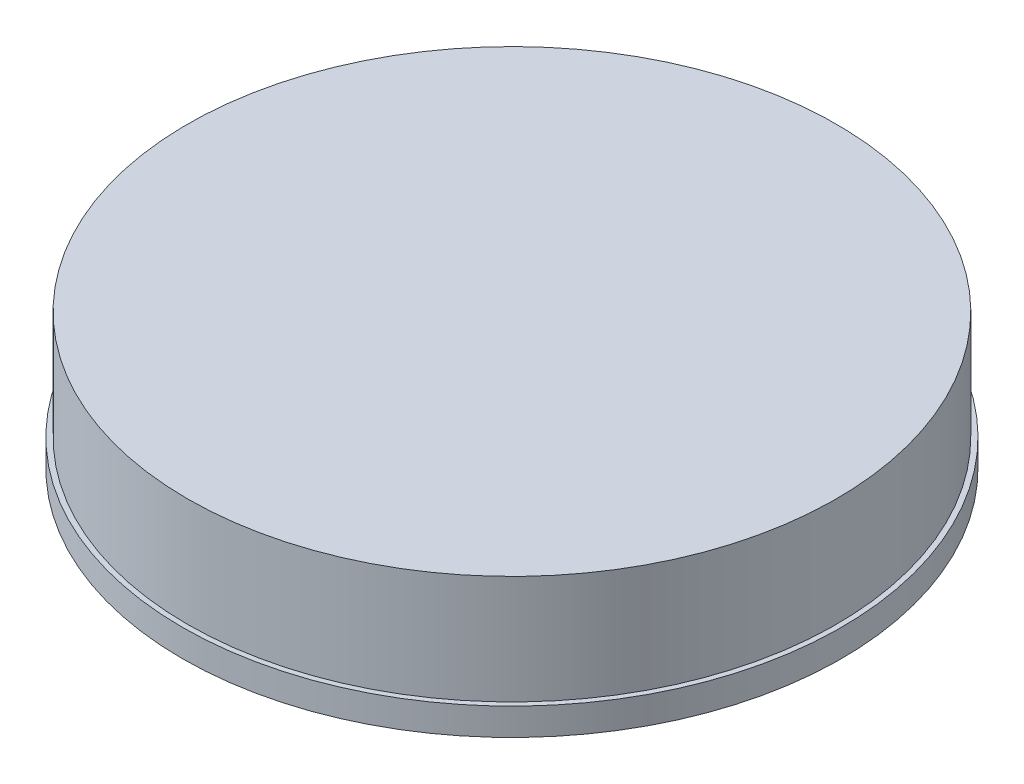
ISO-10303-21;
HEADER;
FILE_DESCRIPTION(('STEP AP214'),'2;1');
FILE_NAME('part.step','',(''),(''),'','','');
FILE_SCHEMA(('AUTOMOTIVE_DESIGN { 1 0 10303 214 1 1 1 1 }'));
ENDSEC;
DATA;
#1=APPLICATION_CONTEXT('core data for automotive mechanical design processes');
#2=APPLICATION_PROTOCOL_DEFINITION('international standard','automotive_design',2000,#1);
#3=PRODUCT_CONTEXT('',#1,'mechanical');
#4=PRODUCT('Part','Part','',(#3));
#5=PRODUCT_RELATED_PRODUCT_CATEGORY('part','',(#4));
#6=PRODUCT_DEFINITION_FORMATION('','',#4);
#7=PRODUCT_DEFINITION_CONTEXT('part definition',#1,'design');
#8=PRODUCT_DEFINITION('design','',#6,#7);
#9=PRODUCT_DEFINITION_SHAPE('','',#8);
#10=(LENGTH_UNIT() NAMED_UNIT(*) SI_UNIT(.MILLI.,.METRE.));
#11=(NAMED_UNIT(*) PLANE_ANGLE_UNIT() SI_UNIT($,.RADIAN.));
#12=(NAMED_UNIT(*) SI_UNIT($,.STERADIAN.) SOLID_ANGLE_UNIT());
#13=UNCERTAINTY_MEASURE_WITH_UNIT(LENGTH_MEASURE(1.E-05),#10,'distance_accuracy_value','');
#14=(GEOMETRIC_REPRESENTATION_CONTEXT(3) GLOBAL_UNCERTAINTY_ASSIGNED_CONTEXT((#13)) GLOBAL_UNIT_ASSIGNED_CONTEXT((#10,
#11,#12)) REPRESENTATION_CONTEXT('',''));
#15=CARTESIAN_POINT('',(0.,0.,0.));
#16=DIRECTION('',(0.,0.,1.));
#17=DIRECTION('',(1.,0.,0.));
#18=AXIS2_PLACEMENT_3D('',#15,#16,#17);
#19=CARTESIAN_POINT('',(0.,0.8,0.));
#20=DIRECTION('',(0.,-1.,0.));
#21=DIRECTION('',(0.,0.,-1.));
#22=AXIS2_PLACEMENT_3D('',#19,#20,#21);
#23=CYLINDRICAL_SURFACE('',#22,9.7);
#24=CARTESIAN_POINT('',(0.,0.8,0.));
#25=DIRECTION('',(0.,1.,0.));
#26=DIRECTION('',(0.,0.,1.));
#27=AXIS2_PLACEMENT_3D('',#24,#25,#26);
#28=CIRCLE('',#27,9.7);
#29=CARTESIAN_POINT('',(0.,0.8,9.7));
#30=VERTEX_POINT('',#29);
#31=EDGE_CURVE('E45',#30,#30,#28,.T.);
#32=ORIENTED_EDGE('',*,*,#31,.F.);
#33=EDGE_LOOP('',(#32));
#34=FACE_BOUND('',#33,.T.);
#35=CARTESIAN_POINT('',(0.,0.,0.));
#36=DIRECTION('',(0.,1.,0.));
#37=DIRECTION('',(0.,0.,1.));
#38=AXIS2_PLACEMENT_3D('',#35,#36,#37);
#39=CIRCLE('',#38,9.7);
#40=CARTESIAN_POINT('',(0.,0.,9.7));
#41=VERTEX_POINT('',#40);
#42=EDGE_CURVE('E40',#41,#41,#39,.T.);
#43=ORIENTED_EDGE('',*,*,#42,.T.);
#44=EDGE_LOOP('',(#43));
#45=FACE_BOUND('',#44,.T.);
#46=ADVANCED_FACE('F37',(#34,#45),#23,.T.);
#47=CARTESIAN_POINT('',(0.,0.8,0.));
#48=DIRECTION('',(0.,1.,0.));
#49=DIRECTION('',(0.,0.,1.));
#50=AXIS2_PLACEMENT_3D('',#47,#48,#49);
#51=PLANE('',#50);
#52=CARTESIAN_POINT('',(0.,0.8,0.));
#53=DIRECTION('',(0.,1.,0.));
#54=DIRECTION('',(0.,0.,1.));
#55=AXIS2_PLACEMENT_3D('',#52,#53,#54);
#56=CIRCLE('',#55,9.55);
#57=CARTESIAN_POINT('',(0.,0.8,9.55));
#58=VERTEX_POINT('',#57);
#59=EDGE_CURVE('E10',#58,#58,#56,.T.);
#60=ORIENTED_EDGE('',*,*,#59,.F.);
#61=EDGE_LOOP('',(#60));
#62=FACE_BOUND('',#61,.T.);
#63=ORIENTED_EDGE('',*,*,#31,.T.);
#64=EDGE_LOOP('',(#63));
#65=FACE_BOUND('',#64,.T.);
#66=ADVANCED_FACE('F78',(#62,#65),#51,.T.);
#67=CARTESIAN_POINT('',(0.,0.,0.));
#68=DIRECTION('',(0.,1.,0.));
#69=DIRECTION('',(0.,0.,1.));
#70=AXIS2_PLACEMENT_3D('',#67,#68,#69);
#71=PLANE('',#70);
#72=CARTESIAN_POINT('',(0.,0.,0.));
#73=DIRECTION('',(0.,-1.,0.));
#74=DIRECTION('',(0.,0.,-1.));
#75=AXIS2_PLACEMENT_3D('',#72,#73,#74);
#76=CIRCLE('',#75,8.75);
#77=CARTESIAN_POINT('',(0.,0.,-8.75));
#78=VERTEX_POINT('',#77);
#79=EDGE_CURVE('E57',#78,#78,#76,.T.);
#80=ORIENTED_EDGE('',*,*,#79,.F.);
#81=EDGE_LOOP('',(#80));
#82=FACE_BOUND('',#81,.T.);
#83=ORIENTED_EDGE('',*,*,#42,.F.);
#84=EDGE_LOOP('',(#83));
#85=FACE_BOUND('',#84,.T.);
#86=ADVANCED_FACE('F74',(#82,#85),#71,.F.);
#87=CARTESIAN_POINT('',(0.,4.,0.));
#88=DIRECTION('',(0.,-1.,0.));
#89=DIRECTION('',(0.,0.,-1.));
#90=AXIS2_PLACEMENT_3D('',#87,#88,#89);
#91=CYLINDRICAL_SURFACE('',#90,9.55);
#92=CARTESIAN_POINT('',(0.,4.,0.));
#93=DIRECTION('',(0.,1.,0.));
#94=DIRECTION('',(0.,0.,1.));
#95=AXIS2_PLACEMENT_3D('',#92,#93,#94);
#96=CIRCLE('',#95,9.55);
#97=CARTESIAN_POINT('',(0.,4.,9.55));
#98=VERTEX_POINT('',#97);
#99=EDGE_CURVE('E52',#98,#98,#96,.T.);
#100=ORIENTED_EDGE('',*,*,#99,.F.);
#101=EDGE_LOOP('',(#100));
#102=FACE_BOUND('',#101,.T.);
#103=ORIENTED_EDGE('',*,*,#59,.T.);
#104=EDGE_LOOP('',(#103));
#105=FACE_BOUND('',#104,.T.);
#106=ADVANCED_FACE('F77',(#102,#105),#91,.T.);
#107=CARTESIAN_POINT('',(0.,4.,0.));
#108=DIRECTION('',(0.,1.,0.));
#109=DIRECTION('',(0.,0.,1.));
#110=AXIS2_PLACEMENT_3D('',#107,#108,#109);
#111=PLANE('',#110);
#112=ORIENTED_EDGE('',*,*,#99,.T.);
#113=EDGE_LOOP('',(#112));
#114=FACE_BOUND('',#113,.T.);
#115=ADVANCED_FACE('F70',(#114),#111,.T.);
#116=CARTESIAN_POINT('',(0.,3.2,0.));
#117=DIRECTION('',(0.,-1.,0.));
#118=DIRECTION('',(0.,0.,-1.));
#119=AXIS2_PLACEMENT_3D('',#116,#117,#118);
#120=CYLINDRICAL_SURFACE('',#119,8.75);
#121=CARTESIAN_POINT('',(0.,3.2,0.));
#122=DIRECTION('',(0.,-1.,0.));
#123=DIRECTION('',(0.,0.,-1.));
#124=AXIS2_PLACEMENT_3D('',#121,#122,#123);
#125=CIRCLE('',#124,8.75);
#126=CARTESIAN_POINT('',(0.,3.2,-8.75));
#127=VERTEX_POINT('',#126);
#128=EDGE_CURVE('E56',#127,#127,#125,.T.);
#129=ORIENTED_EDGE('',*,*,#128,.F.);
#130=EDGE_LOOP('',(#129));
#131=FACE_BOUND('',#130,.T.);
#132=ORIENTED_EDGE('',*,*,#79,.T.);
#133=EDGE_LOOP('',(#132));
#134=FACE_BOUND('',#133,.T.);
#135=ADVANCED_FACE('F67',(#131,#134),#120,.F.);
#136=CARTESIAN_POINT('',(0.,3.2,0.));
#137=DIRECTION('',(0.,-1.,0.));
#138=DIRECTION('',(0.,0.,-1.));
#139=AXIS2_PLACEMENT_3D('',#136,#137,#138);
#140=PLANE('',#139);
#141=ORIENTED_EDGE('',*,*,#128,.T.);
#142=EDGE_LOOP('',(#141));
#143=FACE_BOUND('',#142,.T.);
#144=ADVANCED_FACE('F65',(#143),#140,.T.);
#145=CLOSED_SHELL('',(#46,#66,#86,#106,#115,#135,#144));
#146=MANIFOLD_SOLID_BREP('B2',#145);
#147=ADVANCED_BREP_SHAPE_REPRESENTATION('',(#18,#146),#14);
#148=SHAPE_DEFINITION_REPRESENTATION(#9,#147);
ENDSEC;
END-ISO-10303-21;
